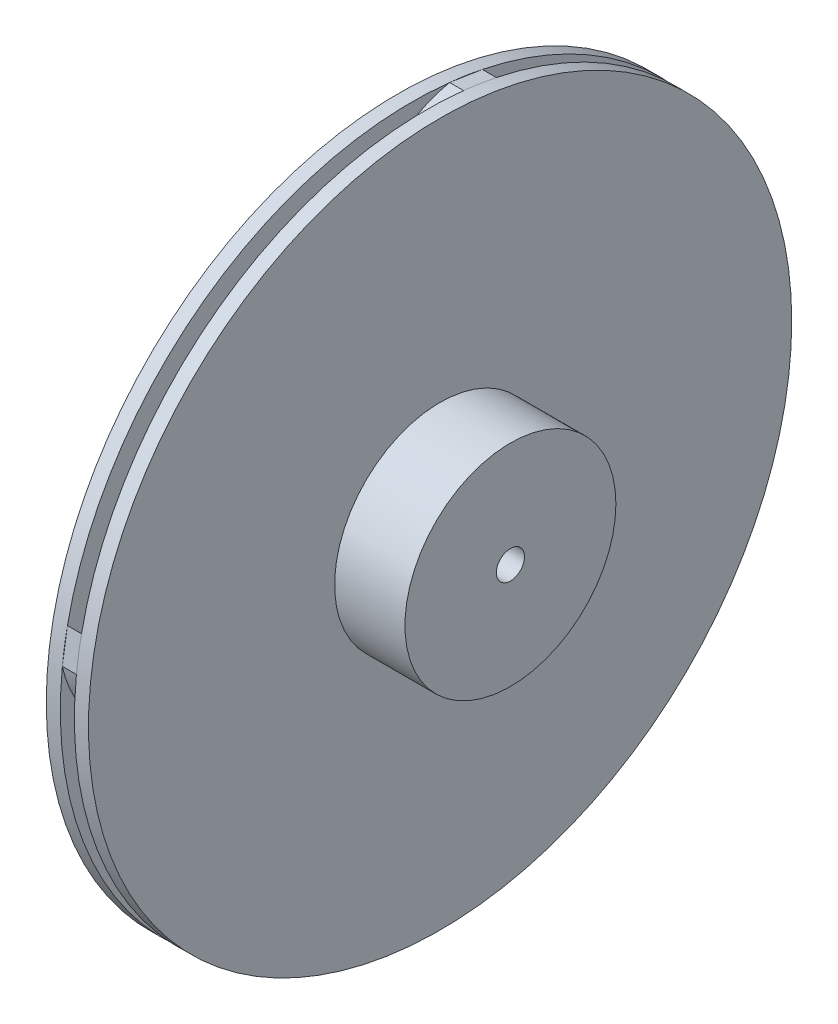
ISO-10303-21;
HEADER;
FILE_DESCRIPTION(('STEP AP214'),'2;1');
FILE_NAME('part.step','',(''),(''),'','','');
FILE_SCHEMA(('AUTOMOTIVE_DESIGN { 1 0 10303 214 1 1 1 1 }'));
ENDSEC;
DATA;
#1=APPLICATION_CONTEXT('core data for automotive mechanical design processes');
#2=APPLICATION_PROTOCOL_DEFINITION('international standard','automotive_design',2000,#1);
#3=PRODUCT_CONTEXT('',#1,'mechanical');
#4=PRODUCT('Part','Part','',(#3));
#5=PRODUCT_RELATED_PRODUCT_CATEGORY('part','',(#4));
#6=PRODUCT_DEFINITION_FORMATION('','',#4);
#7=PRODUCT_DEFINITION_CONTEXT('part definition',#1,'design');
#8=PRODUCT_DEFINITION('design','',#6,#7);
#9=PRODUCT_DEFINITION_SHAPE('','',#8);
#10=(LENGTH_UNIT() NAMED_UNIT(*) SI_UNIT(.MILLI.,.METRE.));
#11=(NAMED_UNIT(*) PLANE_ANGLE_UNIT() SI_UNIT($,.RADIAN.));
#12=(NAMED_UNIT(*) SI_UNIT($,.STERADIAN.) SOLID_ANGLE_UNIT());
#13=UNCERTAINTY_MEASURE_WITH_UNIT(LENGTH_MEASURE(1.E-05),#10,'distance_accuracy_value','');
#14=(GEOMETRIC_REPRESENTATION_CONTEXT(3) GLOBAL_UNCERTAINTY_ASSIGNED_CONTEXT((#13)) GLOBAL_UNIT_ASSIGNED_CONTEXT((#10,
#11,#12)) REPRESENTATION_CONTEXT('',''));
#15=CARTESIAN_POINT('',(0.,0.,0.));
#16=DIRECTION('',(0.,0.,1.));
#17=DIRECTION('',(1.,0.,0.));
#18=AXIS2_PLACEMENT_3D('',#15,#16,#17);
#19=CARTESIAN_POINT('',(0.,7.12628691593959,-14.723543306288));
#20=DIRECTION('',(1.,0.,0.));
#21=DIRECTION('',(0.,0.,-1.));
#22=AXIS2_PLACEMENT_3D('',#19,#20,#21);
#23=PLANE('',#22);
#24=CARTESIAN_POINT('',(0.,0.,0.));
#25=DIRECTION('',(1.,0.,0.));
#26=DIRECTION('',(0.,0.,-1.));
#27=AXIS2_PLACEMENT_3D('',#24,#25,#26);
#28=CIRCLE('',#27,5.);
#29=CARTESIAN_POINT('',(0.,5.,0.));
#30=VERTEX_POINT('',#29);
#31=CARTESIAN_POINT('',(0.,4.77189603041447,1.49298636126208));
#32=VERTEX_POINT('',#31);
#33=EDGE_CURVE('E190',#30,#32,#28,.T.);
#34=ORIENTED_EDGE('',*,*,#33,.F.);
#35=CARTESIAN_POINT('',(0.,4.77189603041447,1.49298636126208));
#36=CARTESIAN_POINT('',(0.,5.,0.));
#37=B_SPLINE_CURVE_WITH_KNOTS('',1,(#35,#36),.UNSPECIFIED.,.F.,.F.,(2,2),(0.,1.),.UNSPECIFIED.);
#38=EDGE_CURVE('E253',#32,#30,#37,.T.);
#39=ORIENTED_EDGE('',*,*,#38,.F.);
#40=EDGE_LOOP('',(#34,#39));
#41=FACE_BOUND('',#40,.T.);
#42=ADVANCED_FACE('F33',(#41),#23,.F.);
#43=CARTESIAN_POINT('',(0.,-14.7235433062881,-7.12628691593953));
#44=DIRECTION('',(1.,0.,0.));
#45=DIRECTION('',(0.,0.,-1.));
#46=AXIS2_PLACEMENT_3D('',#43,#44,#45);
#47=PLANE('',#46);
#48=CARTESIAN_POINT('',(0.,0.,-5.));
#49=VERTEX_POINT('',#48);
#50=CARTESIAN_POINT('',(0.,1.49298636126206,-4.77189603041448));
#51=VERTEX_POINT('',#50);
#52=EDGE_CURVE('E43',#49,#51,#28,.T.);
#53=ORIENTED_EDGE('',*,*,#52,.F.);
#54=CARTESIAN_POINT('',(0.,1.49298636126206,-4.77189603041448));
#55=CARTESIAN_POINT('',(0.,0.,-5.));
#56=B_SPLINE_CURVE_WITH_KNOTS('',1,(#54,#55),.UNSPECIFIED.,.F.,.F.,(2,2),(0.,1.),.UNSPECIFIED.);
#57=EDGE_CURVE('E150',#51,#49,#56,.T.);
#58=ORIENTED_EDGE('',*,*,#57,.F.);
#59=EDGE_LOOP('',(#53,#58));
#60=FACE_BOUND('',#59,.T.);
#61=ADVANCED_FACE('F152',(#60),#47,.F.);
#62=CARTESIAN_POINT('',(0.,-7.12628691593948,14.7235433062881));
#63=DIRECTION('',(1.,0.,0.));
#64=DIRECTION('',(0.,0.,-1.));
#65=AXIS2_PLACEMENT_3D('',#62,#63,#64);
#66=PLANE('',#65);
#67=CARTESIAN_POINT('',(0.,-5.,0.));
#68=VERTEX_POINT('',#67);
#69=CARTESIAN_POINT('',(0.,-4.77189603041448,-1.49298636126205));
#70=VERTEX_POINT('',#69);
#71=EDGE_CURVE('E201',#68,#70,#28,.T.);
#72=ORIENTED_EDGE('',*,*,#71,.F.);
#73=CARTESIAN_POINT('',(0.,-4.77189603041448,-1.49298636126205));
#74=CARTESIAN_POINT('',(0.,-5.,0.));
#75=B_SPLINE_CURVE_WITH_KNOTS('',1,(#73,#74),.UNSPECIFIED.,.F.,.F.,(2,2),(0.,1.),.UNSPECIFIED.);
#76=EDGE_CURVE('E372',#70,#68,#75,.T.);
#77=ORIENTED_EDGE('',*,*,#76,.F.);
#78=EDGE_LOOP('',(#72,#77));
#79=FACE_BOUND('',#78,.T.);
#80=ADVANCED_FACE('F464',(#79),#66,.F.);
#81=CARTESIAN_POINT('',(0.,14.7235433062881,7.12628691593943));
#82=DIRECTION('',(1.,0.,0.));
#83=DIRECTION('',(0.,0.,-1.));
#84=AXIS2_PLACEMENT_3D('',#81,#82,#83);
#85=PLANE('',#84);
#86=CARTESIAN_POINT('',(0.,0.,5.));
#87=VERTEX_POINT('',#86);
#88=CARTESIAN_POINT('',(0.,-1.49298636126203,4.77189603041449));
#89=VERTEX_POINT('',#88);
#90=EDGE_CURVE('E11',#87,#89,#28,.T.);
#91=ORIENTED_EDGE('',*,*,#90,.F.);
#92=CARTESIAN_POINT('',(0.,-1.49298636126203,4.77189603041449));
#93=CARTESIAN_POINT('',(0.,0.,5.));
#94=B_SPLINE_CURVE_WITH_KNOTS('',1,(#92,#93),.UNSPECIFIED.,.F.,.F.,(2,2),(0.,1.),.UNSPECIFIED.);
#95=EDGE_CURVE('E584',#89,#87,#94,.T.);
#96=ORIENTED_EDGE('',*,*,#95,.F.);
#97=EDGE_LOOP('',(#91,#96));
#98=FACE_BOUND('',#97,.T.);
#99=ADVANCED_FACE('F448',(#98),#85,.F.);
#100=CARTESIAN_POINT('',(1.,0.,0.));
#101=DIRECTION('',(1.,0.,0.));
#102=DIRECTION('',(0.,0.,-1.));
#103=AXIS2_PLACEMENT_3D('',#100,#101,#102);
#104=PLANE('',#103);
#105=CARTESIAN_POINT('',(1.,0.,5.));
#106=CARTESIAN_POINT('',(1.,4.49752966090155,10.7345356444935));
#107=CARTESIAN_POINT('',(1.,18.0772656213493,8.40439040059219));
#108=CARTESIAN_POINT('',(1.,22.9031519708675,-1.37145407623374));
#109=CARTESIAN_POINT('',(1.,24.4948974278317,-5.00000000000025));
#110=B_SPLINE_CURVE_WITH_KNOTS('',3,(#105,#106,#107,#108,#109),.UNSPECIFIED.,.F.,.F.,(4,1,4),
(0.,0.618777627560053,1.),.UNSPECIFIED.);
#111=CARTESIAN_POINT('',(1.,0.,5.));
#112=VERTEX_POINT('',#111);
#113=CARTESIAN_POINT('',(1.,24.4948974278318,-5.0000000000001));
#114=VERTEX_POINT('',#113);
#115=EDGE_CURVE('E58',#112,#114,#110,.T.);
#116=ORIENTED_EDGE('',*,*,#115,.T.);
#117=CARTESIAN_POINT('',(1.,0.,0.));
#118=DIRECTION('',(1.,0.,0.));
#119=DIRECTION('',(0.,0.,-1.));
#120=AXIS2_PLACEMENT_3D('',#117,#118,#119);
#121=CIRCLE('',#120,25.);
#122=CARTESIAN_POINT('',(1.,-2.6730314072638,-24.8566872912659));
#123=VERTEX_POINT('',#122);
#124=EDGE_CURVE('E259',#123,#114,#121,.T.);
#125=ORIENTED_EDGE('',*,*,#124,.F.);
#126=CARTESIAN_POINT('',(1.,-2.6730314072638,-24.8566872912659));
#127=CARTESIAN_POINT('',(1.,-1.10498355753693,-24.5506183011015));
#128=CARTESIAN_POINT('',(1.,2.35094401884182,-22.3919045737709));
#129=CARTESIAN_POINT('',(1.,7.16558422053054,-18.6304853513954));
#130=CARTESIAN_POINT('',(1.,10.3228529409846,-12.6682103367622));
#131=CARTESIAN_POINT('',(1.,11.0632116871101,-6.922460382645));
#132=CARTESIAN_POINT('',(1.,9.37578297149706,-1.51635149298295));
#133=CARTESIAN_POINT('',(1.,6.92341697117121,1.33443590127004));
#134=CARTESIAN_POINT('',(1.,4.77189603041447,1.49298636126208));
#135=B_SPLINE_CURVE_WITH_KNOTS('',3,(#126,#127,#128,#129,#130,#131,#132,#133,#134),
.UNSPECIFIED.,.F.,.F.,(4,1,1,1,1,1,4),(0.,0.135621201148051,0.347195592503912,0.517383452822031,
0.703735102708078,0.827493936990259,1.),.UNSPECIFIED.);
#136=CARTESIAN_POINT('',(1.,4.77189603041447,1.49298636126208));
#137=VERTEX_POINT('',#136);
#138=EDGE_CURVE('E301',#123,#137,#135,.T.);
#139=ORIENTED_EDGE('',*,*,#138,.T.);
#140=CARTESIAN_POINT('',(1.,0.,0.));
#141=DIRECTION('',(1.,0.,0.));
#142=DIRECTION('',(0.,0.,-1.));
#143=AXIS2_PLACEMENT_3D('',#140,#141,#142);
#144=CIRCLE('',#143,5.);
#145=EDGE_CURVE('E516',#137,#112,#144,.T.);
#146=ORIENTED_EDGE('',*,*,#145,.T.);
#147=EDGE_LOOP('',(#116,#125,#139,#146));
#148=FACE_BOUND('',#147,.T.);
#149=ADVANCED_FACE('F444',(#148),#104,.F.);
#150=CARTESIAN_POINT('',(1.,24.4948974278317,-5.00000000000026));
#151=CARTESIAN_POINT('',(1.,24.8566872912659,-2.67303140726406));
#152=B_SPLINE_CURVE_WITH_KNOTS('',1,(#150,#151),.UNSPECIFIED.,.F.,.F.,(2,2),(0.,1.),.UNSPECIFIED.);
#153=CARTESIAN_POINT('',(1.,24.8566872912659,-2.67303140726406));
#154=VERTEX_POINT('',#153);
#155=EDGE_CURVE('E50',#114,#154,#152,.T.);
#156=ORIENTED_EDGE('',*,*,#155,.T.);
#157=EDGE_CURVE('E542',#114,#154,#121,.T.);
#158=ORIENTED_EDGE('',*,*,#157,.F.);
#159=EDGE_LOOP('',(#156,#158));
#160=FACE_BOUND('',#159,.T.);
#161=ADVANCED_FACE('F447',(#160),#104,.F.);
#162=CARTESIAN_POINT('',(1.,24.8566872912659,-2.67303140726406));
#163=CARTESIAN_POINT('',(1.,24.5506183011015,-1.10498355753719));
#164=CARTESIAN_POINT('',(1.,22.3919045737709,2.35094401884158));
#165=CARTESIAN_POINT('',(1.,18.6304853513955,7.16558422053034));
#166=CARTESIAN_POINT('',(1.,12.6682103367623,10.3228529409845));
#167=CARTESIAN_POINT('',(1.,6.92246038264511,11.06321168711));
#168=CARTESIAN_POINT('',(1.,1.51635149298305,9.37578297149705));
#169=CARTESIAN_POINT('',(1.,-1.33443590126997,6.92341697117123));
#170=CARTESIAN_POINT('',(1.,-1.49298636126203,4.77189603041449));
#171=B_SPLINE_CURVE_WITH_KNOTS('',3,(#162,#163,#164,#165,#166,#167,#168,#169,#170),
.UNSPECIFIED.,.F.,.F.,(4,1,1,1,1,1,4),(0.,0.135621201148051,0.347195592503912,0.517383452822031,
0.703735102708078,0.827493936990259,1.),.UNSPECIFIED.);
#172=CARTESIAN_POINT('',(1.,-1.49298636126203,4.77189603041449));
#173=VERTEX_POINT('',#172);
#174=EDGE_CURVE('E564',#154,#173,#171,.T.);
#175=ORIENTED_EDGE('',*,*,#174,.T.);
#176=CARTESIAN_POINT('',(1.,-5.,0.));
#177=VERTEX_POINT('',#176);
#178=EDGE_CURVE('E518',#173,#177,#144,.T.);
#179=ORIENTED_EDGE('',*,*,#178,.T.);
#180=CARTESIAN_POINT('',(1.,-5.,0.));
#181=CARTESIAN_POINT('',(1.,-10.7345356444935,4.49752966090151));
#182=CARTESIAN_POINT('',(1.,-8.40439040059226,18.0772656213493));
#183=CARTESIAN_POINT('',(1.,1.37145407623366,22.9031519708675));
#184=CARTESIAN_POINT('',(1.,5.00000000000017,24.4948974278318));
#185=B_SPLINE_CURVE_WITH_KNOTS('',3,(#180,#181,#182,#183,#184),.UNSPECIFIED.,.F.,.F.,(4,1,4),
(0.,0.618777627560053,1.),.UNSPECIFIED.);
#186=CARTESIAN_POINT('',(1.,5.00000000000008,24.4948974278318));
#187=VERTEX_POINT('',#186);
#188=EDGE_CURVE('E628',#177,#187,#185,.T.);
#189=ORIENTED_EDGE('',*,*,#188,.T.);
#190=EDGE_CURVE('E261',#154,#187,#121,.T.);
#191=ORIENTED_EDGE('',*,*,#190,.F.);
#192=EDGE_LOOP('',(#175,#179,#189,#191));
#193=FACE_BOUND('',#192,.T.);
#194=ADVANCED_FACE('F654',(#193),#104,.F.);
#195=CARTESIAN_POINT('',(1.,5.00000000000017,24.4948974278318));
#196=CARTESIAN_POINT('',(1.,2.67303140726398,24.8566872912659));
#197=B_SPLINE_CURVE_WITH_KNOTS('',1,(#195,#196),.UNSPECIFIED.,.F.,.F.,(2,2),(0.,1.),.UNSPECIFIED.);
#198=CARTESIAN_POINT('',(1.,2.67303140726398,24.8566872912659));
#199=VERTEX_POINT('',#198);
#200=EDGE_CURVE('E621',#187,#199,#197,.T.);
#201=ORIENTED_EDGE('',*,*,#200,.T.);
#202=EDGE_CURVE('E534',#187,#199,#121,.T.);
#203=ORIENTED_EDGE('',*,*,#202,.F.);
#204=EDGE_LOOP('',(#201,#203));
#205=FACE_BOUND('',#204,.T.);
#206=ADVANCED_FACE('F656',(#205),#104,.F.);
#207=CARTESIAN_POINT('',(1.,2.67303140726398,24.8566872912659));
#208=CARTESIAN_POINT('',(1.,1.1049835575371,24.5506183011015));
#209=CARTESIAN_POINT('',(1.,-2.35094401884166,22.3919045737709));
#210=CARTESIAN_POINT('',(1.,-7.1655842205304,18.6304853513955));
#211=CARTESIAN_POINT('',(1.,-10.3228529409845,12.6682103367623));
#212=CARTESIAN_POINT('',(1.,-11.06321168711,6.92246038264507));
#213=CARTESIAN_POINT('',(1.,-9.37578297149705,1.51635149298301));
#214=CARTESIAN_POINT('',(1.,-6.92341697117122,-1.33443590126999));
#215=CARTESIAN_POINT('',(1.,-4.77189603041448,-1.49298636126205));
#216=B_SPLINE_CURVE_WITH_KNOTS('',3,(#207,#208,#209,#210,#211,#212,#213,#214,#215),
.UNSPECIFIED.,.F.,.F.,(4,1,1,1,1,1,4),(0.,0.135621201148051,0.347195592503912,0.517383452822031,
0.703735102708078,0.827493936990259,1.),.UNSPECIFIED.);
#217=CARTESIAN_POINT('',(1.,-4.77189603041448,-1.49298636126205));
#218=VERTEX_POINT('',#217);
#219=EDGE_CURVE('E405',#199,#218,#216,.T.);
#220=ORIENTED_EDGE('',*,*,#219,.T.);
#221=CARTESIAN_POINT('',(1.,0.,-5.));
#222=VERTEX_POINT('',#221);
#223=EDGE_CURVE('E515',#218,#222,#144,.T.);
#224=ORIENTED_EDGE('',*,*,#223,.T.);
#225=CARTESIAN_POINT('',(1.,0.,-5.));
#226=CARTESIAN_POINT('',(1.,-4.49752966090147,-10.7345356444935));
#227=CARTESIAN_POINT('',(1.,-18.0772656213492,-8.40439040059232));
#228=CARTESIAN_POINT('',(1.,-22.9031519708675,1.37145407623358));
#229=CARTESIAN_POINT('',(1.,-24.4948974278318,5.00000000000008));
#230=B_SPLINE_CURVE_WITH_KNOTS('',3,(#225,#226,#227,#228,#229),.UNSPECIFIED.,.F.,.F.,(4,1,4),
(0.,0.618777627560053,1.),.UNSPECIFIED.);
#231=CARTESIAN_POINT('',(1.,-24.4948974278318,5.00000000000006));
#232=VERTEX_POINT('',#231);
#233=EDGE_CURVE('E414',#222,#232,#230,.T.);
#234=ORIENTED_EDGE('',*,*,#233,.T.);
#235=EDGE_CURVE('E538',#199,#232,#121,.T.);
#236=ORIENTED_EDGE('',*,*,#235,.F.);
#237=EDGE_LOOP('',(#220,#224,#234,#236));
#238=FACE_BOUND('',#237,.T.);
#239=ADVANCED_FACE('F658',(#238),#104,.F.);
#240=CARTESIAN_POINT('',(1.,-24.4948974278318,5.00000000000009));
#241=CARTESIAN_POINT('',(1.,-24.8566872912659,2.67303140726389));
#242=B_SPLINE_CURVE_WITH_KNOTS('',1,(#240,#241),.UNSPECIFIED.,.F.,.F.,(2,2),(0.,1.),.UNSPECIFIED.);
#243=CARTESIAN_POINT('',(1.,-24.8566872912659,2.67303140726389));
#244=VERTEX_POINT('',#243);
#245=EDGE_CURVE('E423',#232,#244,#242,.T.);
#246=ORIENTED_EDGE('',*,*,#245,.T.);
#247=EDGE_CURVE('E533',#232,#244,#121,.T.);
#248=ORIENTED_EDGE('',*,*,#247,.F.);
#249=EDGE_LOOP('',(#246,#248));
#250=FACE_BOUND('',#249,.T.);
#251=ADVANCED_FACE('F458',(#250),#104,.F.);
#252=CARTESIAN_POINT('',(1.,-24.8566872912659,2.67303140726389));
#253=CARTESIAN_POINT('',(1.,-24.5506183011015,1.10498355753702));
#254=CARTESIAN_POINT('',(1.,-22.3919045737709,-2.35094401884174));
#255=CARTESIAN_POINT('',(1.,-18.6304853513954,-7.16558422053047));
#256=CARTESIAN_POINT('',(1.,-12.6682103367622,-10.3228529409846));
#257=CARTESIAN_POINT('',(1.,-6.92246038264504,-11.0632116871101));
#258=CARTESIAN_POINT('',(1.,-1.51635149298298,-9.37578297149706));
#259=CARTESIAN_POINT('',(1.,1.33443590127001,-6.92341697117122));
#260=CARTESIAN_POINT('',(1.,1.49298636126206,-4.77189603041448));
#261=B_SPLINE_CURVE_WITH_KNOTS('',3,(#252,#253,#254,#255,#256,#257,#258,#259,#260),
.UNSPECIFIED.,.F.,.F.,(4,1,1,1,1,1,4),(0.,0.135621201148051,0.347195592503912,0.517383452822031,
0.703735102708078,0.827493936990259,1.),.UNSPECIFIED.);
#262=CARTESIAN_POINT('',(1.,1.49298636126206,-4.77189603041448));
#263=VERTEX_POINT('',#262);
#264=EDGE_CURVE('E171',#244,#263,#261,.T.);
#265=ORIENTED_EDGE('',*,*,#264,.T.);
#266=CARTESIAN_POINT('',(1.,5.,0.));
#267=VERTEX_POINT('',#266);
#268=EDGE_CURVE('E509',#263,#267,#144,.T.);
#269=ORIENTED_EDGE('',*,*,#268,.T.);
#270=CARTESIAN_POINT('',(1.,5.,0.));
#271=CARTESIAN_POINT('',(1.,10.7345356444935,-4.49752966090144));
#272=CARTESIAN_POINT('',(1.,8.40439040059238,-18.0772656213492));
#273=CARTESIAN_POINT('',(1.,-1.37145407623349,-22.9031519708675));
#274=CARTESIAN_POINT('',(1.,-5.,-24.4948974278318));
#275=B_SPLINE_CURVE_WITH_KNOTS('',3,(#270,#271,#272,#273,#274),.UNSPECIFIED.,.F.,.F.,(4,1,4),
(0.,0.618777627560054,1.),.UNSPECIFIED.);
#276=CARTESIAN_POINT('',(1.,-4.99999999999993,-24.4948974278318));
#277=VERTEX_POINT('',#276);
#278=EDGE_CURVE('E271',#267,#277,#275,.T.);
#279=ORIENTED_EDGE('',*,*,#278,.T.);
#280=EDGE_CURVE('E532',#244,#277,#121,.T.);
#281=ORIENTED_EDGE('',*,*,#280,.F.);
#282=EDGE_LOOP('',(#265,#269,#279,#281));
#283=FACE_BOUND('',#282,.T.);
#284=ADVANCED_FACE('F452',(#283),#104,.F.);
#285=CARTESIAN_POINT('',(1.,7.12628691593959,-14.723543306288));
#286=DIRECTION('',(1.,0.,0.));
#287=DIRECTION('',(0.,0.,-1.));
#288=AXIS2_PLACEMENT_3D('',#285,#286,#287);
#289=PLANE('',#288);
#290=CARTESIAN_POINT('',(1.,4.77189603041447,1.49298636126208));
#291=CARTESIAN_POINT('',(1.,5.,0.));
#292=B_SPLINE_CURVE_WITH_KNOTS('',1,(#290,#291),.UNSPECIFIED.,.F.,.F.,(2,2),(0.,1.),.UNSPECIFIED.);
#293=EDGE_CURVE('E266',#137,#267,#292,.T.);
#294=ORIENTED_EDGE('',*,*,#293,.T.);
#295=EDGE_CURVE('E263',#267,#137,#144,.T.);
#296=ORIENTED_EDGE('',*,*,#295,.T.);
#297=EDGE_LOOP('',(#294,#296));
#298=FACE_BOUND('',#297,.T.);
#299=ADVANCED_FACE('F450',(#298),#289,.T.);
#300=CARTESIAN_POINT('',(1.,4.77189603041447,1.49298636126208));
#301=DIRECTION('',(0.,0.988529009711626,0.151031112551529));
#302=DIRECTION('',(0.,-0.151031112551529,0.988529009711626));
#303=AXIS2_PLACEMENT_3D('',#300,#301,#302);
#304=PLANE('',#303);
#305=ORIENTED_EDGE('',*,*,#38,.T.);
#306=DIRECTION('',(-1.,0.,0.));
#307=VECTOR('',#306,1.);
#308=CARTESIAN_POINT('',(1.,5.,0.));
#309=LINE('',#308,#307);
#310=EDGE_CURVE('E37',#267,#30,#309,.T.);
#311=ORIENTED_EDGE('',*,*,#310,.F.);
#312=ORIENTED_EDGE('',*,*,#293,.F.);
#313=DIRECTION('',(-1.,0.,0.));
#314=VECTOR('',#313,1.);
#315=CARTESIAN_POINT('',(1.,4.77189603041447,1.49298636126208));
#316=LINE('',#315,#314);
#317=EDGE_CURVE('E306',#137,#32,#316,.T.);
#318=ORIENTED_EDGE('',*,*,#317,.T.);
#319=EDGE_LOOP('',(#305,#311,#312,#318));
#320=FACE_BOUND('',#319,.T.);
#321=ADVANCED_FACE('F35',(#320),#304,.F.);
#322=DIRECTION('',(-1.,0.,0.));
#323=VECTOR('',#322,1.);
#324=SURFACE_OF_LINEAR_EXTRUSION('',#275,#323);
#325=CARTESIAN_POINT('',(0.,5.,0.));
#326=CARTESIAN_POINT('',(0.,10.7345356444935,-4.49752966090144));
#327=CARTESIAN_POINT('',(0.,8.40439040059238,-18.0772656213492));
#328=CARTESIAN_POINT('',(0.,-1.37145407623349,-22.9031519708675));
#329=CARTESIAN_POINT('',(0.,-5.,-24.4948974278318));
#330=B_SPLINE_CURVE_WITH_KNOTS('',3,(#325,#326,#327,#328,#329),.UNSPECIFIED.,.F.,.F.,(4,1,4),
(0.,0.618777627560054,1.),.UNSPECIFIED.);
#331=CARTESIAN_POINT('',(0.,-5.,-24.4948974278318));
#332=VERTEX_POINT('',#331);
#333=EDGE_CURVE('E187',#30,#332,#330,.T.);
#334=ORIENTED_EDGE('',*,*,#333,.T.);
#335=DIRECTION('',(-1.,0.,0.));
#336=VECTOR('',#335,1.);
#337=CARTESIAN_POINT('',(1.,-5.,-24.4948974278318));
#338=LINE('',#337,#336);
#339=EDGE_CURVE('E340',#277,#332,#338,.T.);
#340=ORIENTED_EDGE('',*,*,#339,.F.);
#341=ORIENTED_EDGE('',*,*,#278,.F.);
#342=ORIENTED_EDGE('',*,*,#310,.T.);
#343=EDGE_LOOP('',(#334,#340,#341,#342));
#344=FACE_BOUND('',#343,.T.);
#345=ADVANCED_FACE('F288',(#344),#324,.F.);
#346=CARTESIAN_POINT('',(1.,-5.,-24.4948974278318));
#347=DIRECTION('',(0.,0.153631120391854,0.988128270442226));
#348=DIRECTION('',(0.,-0.988128270442226,0.153631120391854));
#349=AXIS2_PLACEMENT_3D('',#346,#347,#348);
#350=PLANE('',#349);
#351=CARTESIAN_POINT('',(0.,-5.,-24.4948974278318));
#352=CARTESIAN_POINT('',(0.,-2.6730314072638,-24.8566872912659));
#353=B_SPLINE_CURVE_WITH_KNOTS('',1,(#351,#352),.UNSPECIFIED.,.F.,.F.,(2,2),(0.,1.),.UNSPECIFIED.);
#354=CARTESIAN_POINT('',(0.,-2.6730314072638,-24.8566872912659));
#355=VERTEX_POINT('',#354);
#356=EDGE_CURVE('E319',#332,#355,#353,.T.);
#357=ORIENTED_EDGE('',*,*,#356,.T.);
#358=DIRECTION('',(-1.,0.,0.));
#359=VECTOR('',#358,1.);
#360=CARTESIAN_POINT('',(1.,-2.6730314072638,-24.8566872912659));
#361=LINE('',#360,#359);
#362=EDGE_CURVE('E338',#123,#355,#361,.T.);
#363=ORIENTED_EDGE('',*,*,#362,.F.);
#364=CARTESIAN_POINT('',(1.,-5.,-24.4948974278318));
#365=CARTESIAN_POINT('',(1.,-2.6730314072638,-24.8566872912659));
#366=B_SPLINE_CURVE_WITH_KNOTS('',1,(#364,#365),.UNSPECIFIED.,.F.,.F.,(2,2),(0.,1.),.UNSPECIFIED.);
#367=EDGE_CURVE('E281',#277,#123,#366,.T.);
#368=ORIENTED_EDGE('',*,*,#367,.F.);
#369=ORIENTED_EDGE('',*,*,#339,.T.);
#370=EDGE_LOOP('',(#357,#363,#368,#369));
#371=FACE_BOUND('',#370,.T.);
#372=ADVANCED_FACE('F291',(#371),#350,.F.);
#373=DIRECTION('',(-1.,0.,0.));
#374=VECTOR('',#373,1.);
#375=SURFACE_OF_LINEAR_EXTRUSION('',#135,#374);
#376=CARTESIAN_POINT('',(0.,-2.6730314072638,-24.8566872912659));
#377=CARTESIAN_POINT('',(0.,-1.10498355753693,-24.5506183011015));
#378=CARTESIAN_POINT('',(0.,2.35094401884182,-22.3919045737709));
#379=CARTESIAN_POINT('',(0.,7.16558422053054,-18.6304853513954));
#380=CARTESIAN_POINT('',(0.,10.3228529409846,-12.6682103367622));
#381=CARTESIAN_POINT('',(0.,11.0632116871101,-6.922460382645));
#382=CARTESIAN_POINT('',(0.,9.37578297149706,-1.51635149298295));
#383=CARTESIAN_POINT('',(0.,6.92341697117121,1.33443590127004));
#384=CARTESIAN_POINT('',(0.,4.77189603041447,1.49298636126208));
#385=B_SPLINE_CURVE_WITH_KNOTS('',3,(#376,#377,#378,#379,#380,#381,#382,#383,#384),
.UNSPECIFIED.,.F.,.F.,(4,1,1,1,1,1,4),(0.,0.135621201148051,0.347195592503912,0.517383452822031,
0.703735102708078,0.827493936990259,1.),.UNSPECIFIED.);
#386=EDGE_CURVE('E272',#355,#32,#385,.T.);
#387=ORIENTED_EDGE('',*,*,#386,.T.);
#388=ORIENTED_EDGE('',*,*,#317,.F.);
#389=ORIENTED_EDGE('',*,*,#138,.F.);
#390=ORIENTED_EDGE('',*,*,#362,.T.);
#391=EDGE_LOOP('',(#387,#388,#389,#390));
#392=FACE_BOUND('',#391,.T.);
#393=ADVANCED_FACE('F295',(#392),#375,.F.);
#394=EDGE_CURVE('E254',#277,#123,#121,.T.);
#395=ORIENTED_EDGE('',*,*,#394,.F.);
#396=ORIENTED_EDGE('',*,*,#367,.T.);
#397=EDGE_LOOP('',(#395,#396));
#398=FACE_BOUND('',#397,.T.);
#399=ADVANCED_FACE('F247',(#398),#104,.F.);
#400=CARTESIAN_POINT('',(2.,0.,0.));
#401=DIRECTION('',(1.,0.,0.));
#402=DIRECTION('',(0.,0.,-1.));
#403=AXIS2_PLACEMENT_3D('',#400,#401,#402);
#404=PLANE('',#403);
#405=CARTESIAN_POINT('',(2.,0.,0.));
#406=DIRECTION('',(1.,0.,0.));
#407=DIRECTION('',(0.,0.,-1.));
#408=AXIS2_PLACEMENT_3D('',#405,#406,#407);
#409=CIRCLE('',#408,7.5);
#410=CARTESIAN_POINT('',(2.,0.,-7.5));
#411=VERTEX_POINT('',#410);
#412=EDGE_CURVE('E210',#411,#411,#409,.T.);
#413=ORIENTED_EDGE('',*,*,#412,.F.);
#414=EDGE_LOOP('',(#413));
#415=FACE_BOUND('',#414,.T.);
#416=CARTESIAN_POINT('',(2.,0.,0.));
#417=DIRECTION('',(1.,0.,0.));
#418=DIRECTION('',(0.,0.,-1.));
#419=AXIS2_PLACEMENT_3D('',#416,#417,#418);
#420=CIRCLE('',#419,25.);
#421=CARTESIAN_POINT('',(2.,0.,-25.));
#422=VERTEX_POINT('',#421);
#423=EDGE_CURVE('E251',#422,#422,#420,.T.);
#424=ORIENTED_EDGE('',*,*,#423,.T.);
#425=EDGE_LOOP('',(#424));
#426=FACE_BOUND('',#425,.T.);
#427=ADVANCED_FACE('F243',(#415,#426),#404,.T.);
#428=CARTESIAN_POINT('',(2.,0.,0.));
#429=DIRECTION('',(-1.,0.,0.));
#430=DIRECTION('',(0.,0.,1.));
#431=AXIS2_PLACEMENT_3D('',#428,#429,#430);
#432=CYLINDRICAL_SURFACE('',#431,25.);
#433=ORIENTED_EDGE('',*,*,#423,.F.);
#434=EDGE_LOOP('',(#433));
#435=FACE_BOUND('',#434,.T.);
#436=ORIENTED_EDGE('',*,*,#394,.T.);
#437=ORIENTED_EDGE('',*,*,#124,.T.);
#438=ORIENTED_EDGE('',*,*,#157,.T.);
#439=ORIENTED_EDGE('',*,*,#190,.T.);
#440=ORIENTED_EDGE('',*,*,#202,.T.);
#441=ORIENTED_EDGE('',*,*,#235,.T.);
#442=ORIENTED_EDGE('',*,*,#247,.T.);
#443=ORIENTED_EDGE('',*,*,#280,.T.);
#444=EDGE_LOOP('',(#436,#437,#438,#439,#440,#441,#442,#443));
#445=FACE_BOUND('',#444,.T.);
#446=ADVANCED_FACE('F246',(#435,#445),#432,.T.);
#447=CARTESIAN_POINT('',(2.,0.,0.));
#448=DIRECTION('',(-1.,0.,0.));
#449=DIRECTION('',(0.,0.,1.));
#450=AXIS2_PLACEMENT_3D('',#447,#448,#449);
#451=CYLINDRICAL_SURFACE('',#450,5.);
#452=CARTESIAN_POINT('',(2.,0.,0.));
#453=DIRECTION('',(1.,0.,0.));
#454=DIRECTION('',(0.,0.,-1.));
#455=AXIS2_PLACEMENT_3D('',#452,#453,#454);
#456=CIRCLE('',#455,5.);
#457=CARTESIAN_POINT('',(2.,0.,-5.));
#458=VERTEX_POINT('',#457);
#459=EDGE_CURVE('E202',#458,#458,#456,.T.);
#460=ORIENTED_EDGE('',*,*,#459,.T.);
#461=EDGE_LOOP('',(#460));
#462=FACE_BOUND('',#461,.T.);
#463=ORIENTED_EDGE('',*,*,#295,.F.);
#464=ORIENTED_EDGE('',*,*,#268,.F.);
#465=EDGE_CURVE('E511',#222,#263,#144,.T.);
#466=ORIENTED_EDGE('',*,*,#465,.F.);
#467=ORIENTED_EDGE('',*,*,#223,.F.);
#468=EDGE_CURVE('E512',#177,#218,#144,.T.);
#469=ORIENTED_EDGE('',*,*,#468,.F.);
#470=ORIENTED_EDGE('',*,*,#178,.F.);
#471=EDGE_CURVE('E523',#112,#173,#144,.T.);
#472=ORIENTED_EDGE('',*,*,#471,.F.);
#473=ORIENTED_EDGE('',*,*,#145,.F.);
#474=EDGE_LOOP('',(#463,#464,#466,#467,#469,#470,#472,#473));
#475=FACE_BOUND('',#474,.T.);
#476=ADVANCED_FACE('F441',(#462,#475),#451,.F.);
#477=CARTESIAN_POINT('',(1.,-14.7235433062881,-7.12628691593953));
#478=DIRECTION('',(1.,0.,0.));
#479=DIRECTION('',(0.,0.,-1.));
#480=AXIS2_PLACEMENT_3D('',#477,#478,#479);
#481=PLANE('',#480);
#482=CARTESIAN_POINT('',(1.,1.49298636126206,-4.77189603041448));
#483=CARTESIAN_POINT('',(1.,0.,-5.));
#484=B_SPLINE_CURVE_WITH_KNOTS('',1,(#482,#483),.UNSPECIFIED.,.F.,.F.,(2,2),(0.,1.),.UNSPECIFIED.);
#485=EDGE_CURVE('E167',#263,#222,#484,.T.);
#486=ORIENTED_EDGE('',*,*,#485,.T.);
#487=ORIENTED_EDGE('',*,*,#465,.T.);
#488=EDGE_LOOP('',(#486,#487));
#489=FACE_BOUND('',#488,.T.);
#490=ADVANCED_FACE('F440',(#489),#481,.T.);
#491=CARTESIAN_POINT('',(1.,1.49298636126206,-4.77189603041448));
#492=DIRECTION('',(0.,0.151031112551526,-0.988529009711626));
#493=DIRECTION('',(0.,0.988529009711626,0.151031112551526));
#494=AXIS2_PLACEMENT_3D('',#491,#492,#493);
#495=PLANE('',#494);
#496=ORIENTED_EDGE('',*,*,#57,.T.);
#497=DIRECTION('',(-1.,0.,0.));
#498=VECTOR('',#497,1.);
#499=CARTESIAN_POINT('',(1.,0.,-5.));
#500=LINE('',#499,#498);
#501=EDGE_CURVE('E508',#222,#49,#500,.T.);
#502=ORIENTED_EDGE('',*,*,#501,.F.);
#503=ORIENTED_EDGE('',*,*,#485,.F.);
#504=DIRECTION('',(-1.,0.,0.));
#505=VECTOR('',#504,1.);
#506=CARTESIAN_POINT('',(1.,1.49298636126206,-4.77189603041448));
#507=LINE('',#506,#505);
#508=EDGE_CURVE('E163',#263,#51,#507,.T.);
#509=ORIENTED_EDGE('',*,*,#508,.T.);
#510=EDGE_LOOP('',(#496,#502,#503,#509));
#511=FACE_BOUND('',#510,.T.);
#512=ADVANCED_FACE('F165',(#511),#495,.F.);
#513=DIRECTION('',(-1.,0.,0.));
#514=VECTOR('',#513,1.);
#515=SURFACE_OF_LINEAR_EXTRUSION('',#230,#514);
#516=CARTESIAN_POINT('',(0.,0.,-5.));
#517=CARTESIAN_POINT('',(0.,-4.49752966090147,-10.7345356444935));
#518=CARTESIAN_POINT('',(0.,-18.0772656213492,-8.40439040059232));
#519=CARTESIAN_POINT('',(0.,-22.9031519708675,1.37145407623358));
#520=CARTESIAN_POINT('',(0.,-24.4948974278318,5.00000000000008));
#521=B_SPLINE_CURVE_WITH_KNOTS('',3,(#516,#517,#518,#519,#520),.UNSPECIFIED.,.F.,.F.,(4,1,4),
(0.,0.618777627560053,1.),.UNSPECIFIED.);
#522=CARTESIAN_POINT('',(0.,-24.4948974278318,5.00000000000008));
#523=VERTEX_POINT('',#522);
#524=EDGE_CURVE('E158',#49,#523,#521,.T.);
#525=ORIENTED_EDGE('',*,*,#524,.T.);
#526=DIRECTION('',(-1.,0.,0.));
#527=VECTOR('',#526,1.);
#528=CARTESIAN_POINT('',(1.,-24.4948974278318,5.00000000000008));
#529=LINE('',#528,#527);
#530=EDGE_CURVE('E506',#232,#523,#529,.T.);
#531=ORIENTED_EDGE('',*,*,#530,.F.);
#532=ORIENTED_EDGE('',*,*,#233,.F.);
#533=ORIENTED_EDGE('',*,*,#501,.T.);
#534=EDGE_LOOP('',(#525,#531,#532,#533));
#535=FACE_BOUND('',#534,.T.);
#536=ADVANCED_FACE('F431',(#535),#515,.F.);
#537=CARTESIAN_POINT('',(1.,-24.4948974278318,5.00000000000009));
#538=DIRECTION('',(0.,0.988128270442225,-0.153631120391855));
#539=DIRECTION('',(0.,0.153631120391855,0.988128270442225));
#540=AXIS2_PLACEMENT_3D('',#537,#538,#539);
#541=PLANE('',#540);
#542=CARTESIAN_POINT('',(0.,-24.4948974278318,5.00000000000009));
#543=CARTESIAN_POINT('',(0.,-24.8566872912659,2.67303140726389));
#544=B_SPLINE_CURVE_WITH_KNOTS('',1,(#542,#543),.UNSPECIFIED.,.F.,.F.,(2,2),(0.,1.),.UNSPECIFIED.);
#545=CARTESIAN_POINT('',(0.,-24.8566872912659,2.67303140726389));
#546=VERTEX_POINT('',#545);
#547=EDGE_CURVE('E182',#523,#546,#544,.T.);
#548=ORIENTED_EDGE('',*,*,#547,.T.);
#549=DIRECTION('',(-1.,0.,0.));
#550=VECTOR('',#549,1.);
#551=CARTESIAN_POINT('',(1.,-24.8566872912659,2.67303140726389));
#552=LINE('',#551,#550);
#553=EDGE_CURVE('E170',#244,#546,#552,.T.);
#554=ORIENTED_EDGE('',*,*,#553,.F.);
#555=ORIENTED_EDGE('',*,*,#245,.F.);
#556=ORIENTED_EDGE('',*,*,#530,.T.);
#557=EDGE_LOOP('',(#548,#554,#555,#556));
#558=FACE_BOUND('',#557,.T.);
#559=ADVANCED_FACE('F435',(#558),#541,.F.);
#560=DIRECTION('',(-1.,0.,0.));
#561=VECTOR('',#560,1.);
#562=SURFACE_OF_LINEAR_EXTRUSION('',#261,#561);
#563=CARTESIAN_POINT('',(0.,-24.8566872912659,2.67303140726389));
#564=CARTESIAN_POINT('',(0.,-24.5506183011015,1.10498355753702));
#565=CARTESIAN_POINT('',(0.,-22.3919045737709,-2.35094401884174));
#566=CARTESIAN_POINT('',(0.,-18.6304853513954,-7.16558422053047));
#567=CARTESIAN_POINT('',(0.,-12.6682103367622,-10.3228529409846));
#568=CARTESIAN_POINT('',(0.,-6.92246038264504,-11.0632116871101));
#569=CARTESIAN_POINT('',(0.,-1.51635149298298,-9.37578297149706));
#570=CARTESIAN_POINT('',(0.,1.33443590127001,-6.92341697117122));
#571=CARTESIAN_POINT('',(0.,1.49298636126206,-4.77189603041448));
#572=B_SPLINE_CURVE_WITH_KNOTS('',3,(#563,#564,#565,#566,#567,#568,#569,#570,#571),
.UNSPECIFIED.,.F.,.F.,(4,1,1,1,1,1,4),(0.,0.135621201148051,0.347195592503912,0.517383452822031,
0.703735102708078,0.827493936990259,1.),.UNSPECIFIED.);
#573=EDGE_CURVE('E175',#546,#51,#572,.T.);
#574=ORIENTED_EDGE('',*,*,#573,.T.);
#575=ORIENTED_EDGE('',*,*,#508,.F.);
#576=ORIENTED_EDGE('',*,*,#264,.F.);
#577=ORIENTED_EDGE('',*,*,#553,.T.);
#578=EDGE_LOOP('',(#574,#575,#576,#577));
#579=FACE_BOUND('',#578,.T.);
#580=ADVANCED_FACE('F177',(#579),#562,.F.);
#581=CARTESIAN_POINT('',(1.,-7.12628691593948,14.7235433062881));
#582=DIRECTION('',(1.,0.,0.));
#583=DIRECTION('',(0.,0.,-1.));
#584=AXIS2_PLACEMENT_3D('',#581,#582,#583);
#585=PLANE('',#584);
#586=CARTESIAN_POINT('',(1.,-4.77189603041448,-1.49298636126205));
#587=CARTESIAN_POINT('',(1.,-5.,0.));
#588=B_SPLINE_CURVE_WITH_KNOTS('',1,(#586,#587),.UNSPECIFIED.,.F.,.F.,(2,2),(0.,1.),.UNSPECIFIED.);
#589=EDGE_CURVE('E397',#218,#177,#588,.T.);
#590=ORIENTED_EDGE('',*,*,#589,.T.);
#591=ORIENTED_EDGE('',*,*,#468,.T.);
#592=EDGE_LOOP('',(#590,#591));
#593=FACE_BOUND('',#592,.T.);
#594=ADVANCED_FACE('F474',(#593),#585,.T.);
#595=CARTESIAN_POINT('',(1.,-4.77189603041448,-1.49298636126205));
#596=DIRECTION('',(0.,-0.988529009711627,-0.151031112551522));
#597=DIRECTION('',(0.,0.151031112551522,-0.988529009711627));
#598=AXIS2_PLACEMENT_3D('',#595,#596,#597);
#599=PLANE('',#598);
#600=ORIENTED_EDGE('',*,*,#76,.T.);
#601=DIRECTION('',(-1.,0.,0.));
#602=VECTOR('',#601,1.);
#603=CARTESIAN_POINT('',(1.,-5.,0.));
#604=LINE('',#603,#602);
#605=EDGE_CURVE('E159',#177,#68,#604,.T.);
#606=ORIENTED_EDGE('',*,*,#605,.F.);
#607=ORIENTED_EDGE('',*,*,#589,.F.);
#608=DIRECTION('',(-1.,0.,0.));
#609=VECTOR('',#608,1.);
#610=CARTESIAN_POINT('',(1.,-4.77189603041448,-1.49298636126205));
#611=LINE('',#610,#609);
#612=EDGE_CURVE('E398',#218,#70,#611,.T.);
#613=ORIENTED_EDGE('',*,*,#612,.T.);
#614=EDGE_LOOP('',(#600,#606,#607,#613));
#615=FACE_BOUND('',#614,.T.);
#616=ADVANCED_FACE('F609',(#615),#599,.F.);
#617=DIRECTION('',(-1.,0.,0.));
#618=VECTOR('',#617,1.);
#619=SURFACE_OF_LINEAR_EXTRUSION('',#185,#618);
#620=CARTESIAN_POINT('',(0.,-5.,0.));
#621=CARTESIAN_POINT('',(0.,-10.7345356444935,4.49752966090151));
#622=CARTESIAN_POINT('',(0.,-8.40439040059226,18.0772656213493));
#623=CARTESIAN_POINT('',(0.,1.37145407623366,22.9031519708675));
#624=CARTESIAN_POINT('',(0.,5.00000000000017,24.4948974278318));
#625=B_SPLINE_CURVE_WITH_KNOTS('',3,(#620,#621,#622,#623,#624),.UNSPECIFIED.,.F.,.F.,(4,1,4),
(0.,0.618777627560053,1.),.UNSPECIFIED.);
#626=CARTESIAN_POINT('',(0.,5.00000000000017,24.4948974278318));
#627=VERTEX_POINT('',#626);
#628=EDGE_CURVE('E365',#68,#627,#625,.T.);
#629=ORIENTED_EDGE('',*,*,#628,.T.);
#630=DIRECTION('',(-1.,0.,0.));
#631=VECTOR('',#630,1.);
#632=CARTESIAN_POINT('',(1.,5.00000000000017,24.4948974278318));
#633=LINE('',#632,#631);
#634=EDGE_CURVE('E408',#187,#627,#633,.T.);
#635=ORIENTED_EDGE('',*,*,#634,.F.);
#636=ORIENTED_EDGE('',*,*,#188,.F.);
#637=ORIENTED_EDGE('',*,*,#605,.T.);
#638=EDGE_LOOP('',(#629,#635,#636,#637));
#639=FACE_BOUND('',#638,.T.);
#640=ADVANCED_FACE('F643',(#639),#619,.F.);
#641=CARTESIAN_POINT('',(1.,5.00000000000017,24.4948974278318));
#642=DIRECTION('',(0.,-0.15363112039186,-0.988128270442224));
#643=DIRECTION('',(0.,0.988128270442225,-0.15363112039186));
#644=AXIS2_PLACEMENT_3D('',#641,#642,#643);
#645=PLANE('',#644);
#646=CARTESIAN_POINT('',(0.,5.00000000000017,24.4948974278318));
#647=CARTESIAN_POINT('',(0.,2.67303140726398,24.8566872912659));
#648=B_SPLINE_CURVE_WITH_KNOTS('',1,(#646,#647),.UNSPECIFIED.,.F.,.F.,(2,2),(0.,1.),.UNSPECIFIED.);
#649=CARTESIAN_POINT('',(0.,2.67303140726398,24.8566872912659));
#650=VERTEX_POINT('',#649);
#651=EDGE_CURVE('E371',#627,#650,#648,.T.);
#652=ORIENTED_EDGE('',*,*,#651,.T.);
#653=DIRECTION('',(-1.,0.,0.));
#654=VECTOR('',#653,1.);
#655=CARTESIAN_POINT('',(1.,2.67303140726398,24.8566872912659));
#656=LINE('',#655,#654);
#657=EDGE_CURVE('E404',#199,#650,#656,.T.);
#658=ORIENTED_EDGE('',*,*,#657,.F.);
#659=ORIENTED_EDGE('',*,*,#200,.F.);
#660=ORIENTED_EDGE('',*,*,#634,.T.);
#661=EDGE_LOOP('',(#652,#658,#659,#660));
#662=FACE_BOUND('',#661,.T.);
#663=ADVANCED_FACE('F614',(#662),#645,.F.);
#664=DIRECTION('',(-1.,0.,0.));
#665=VECTOR('',#664,1.);
#666=SURFACE_OF_LINEAR_EXTRUSION('',#216,#665);
#667=CARTESIAN_POINT('',(0.,2.67303140726398,24.8566872912659));
#668=CARTESIAN_POINT('',(0.,1.1049835575371,24.5506183011015));
#669=CARTESIAN_POINT('',(0.,-2.35094401884166,22.3919045737709));
#670=CARTESIAN_POINT('',(0.,-7.1655842205304,18.6304853513955));
#671=CARTESIAN_POINT('',(0.,-10.3228529409845,12.6682103367623));
#672=CARTESIAN_POINT('',(0.,-11.06321168711,6.92246038264507));
#673=CARTESIAN_POINT('',(0.,-9.37578297149705,1.51635149298301));
#674=CARTESIAN_POINT('',(0.,-6.92341697117122,-1.33443590126999));
#675=CARTESIAN_POINT('',(0.,-4.77189603041448,-1.49298636126205));
#676=B_SPLINE_CURVE_WITH_KNOTS('',3,(#667,#668,#669,#670,#671,#672,#673,#674,#675),
.UNSPECIFIED.,.F.,.F.,(4,1,1,1,1,1,4),(0.,0.135621201148051,0.347195592503912,0.517383452822031,
0.703735102708078,0.827493936990259,1.),.UNSPECIFIED.);
#677=EDGE_CURVE('E374',#650,#70,#676,.T.);
#678=ORIENTED_EDGE('',*,*,#677,.T.);
#679=ORIENTED_EDGE('',*,*,#612,.F.);
#680=ORIENTED_EDGE('',*,*,#219,.F.);
#681=ORIENTED_EDGE('',*,*,#657,.T.);
#682=EDGE_LOOP('',(#678,#679,#680,#681));
#683=FACE_BOUND('',#682,.T.);
#684=ADVANCED_FACE('F611',(#683),#666,.F.);
#685=CARTESIAN_POINT('',(1.,14.7235433062881,7.12628691593943));
#686=DIRECTION('',(1.,0.,0.));
#687=DIRECTION('',(0.,0.,-1.));
#688=AXIS2_PLACEMENT_3D('',#685,#686,#687);
#689=PLANE('',#688);
#690=CARTESIAN_POINT('',(1.,-1.49298636126203,4.77189603041449));
#691=CARTESIAN_POINT('',(1.,0.,5.));
#692=B_SPLINE_CURVE_WITH_KNOTS('',1,(#690,#691),.UNSPECIFIED.,.F.,.F.,(2,2),(0.,1.),.UNSPECIFIED.);
#693=EDGE_CURVE('E569',#173,#112,#692,.T.);
#694=ORIENTED_EDGE('',*,*,#693,.T.);
#695=ORIENTED_EDGE('',*,*,#471,.T.);
#696=EDGE_LOOP('',(#694,#695));
#697=FACE_BOUND('',#696,.T.);
#698=ADVANCED_FACE('F606',(#697),#689,.T.);
#699=CARTESIAN_POINT('',(1.,-1.49298636126203,4.77189603041449));
#700=DIRECTION('',(0.,-0.151031112551519,0.988529009711627));
#701=DIRECTION('',(0.,-0.988529009711627,-0.151031112551519));
#702=AXIS2_PLACEMENT_3D('',#699,#700,#701);
#703=PLANE('',#702);
#704=ORIENTED_EDGE('',*,*,#95,.T.);
#705=DIRECTION('',(-1.,0.,0.));
#706=VECTOR('',#705,1.);
#707=CARTESIAN_POINT('',(1.,0.,5.));
#708=LINE('',#707,#706);
#709=EDGE_CURVE('E377',#112,#87,#708,.T.);
#710=ORIENTED_EDGE('',*,*,#709,.F.);
#711=ORIENTED_EDGE('',*,*,#693,.F.);
#712=DIRECTION('',(-1.,0.,0.));
#713=VECTOR('',#712,1.);
#714=CARTESIAN_POINT('',(1.,-1.49298636126203,4.77189603041449));
#715=LINE('',#714,#713);
#716=EDGE_CURVE('E567',#173,#89,#715,.T.);
#717=ORIENTED_EDGE('',*,*,#716,.T.);
#718=EDGE_LOOP('',(#704,#710,#711,#717));
#719=FACE_BOUND('',#718,.T.);
#720=ADVANCED_FACE('F603',(#719),#703,.F.);
#721=DIRECTION('',(-1.,0.,0.));
#722=VECTOR('',#721,1.);
#723=SURFACE_OF_LINEAR_EXTRUSION('',#110,#722);
#724=CARTESIAN_POINT('',(0.,0.,5.));
#725=CARTESIAN_POINT('',(0.,4.49752966090155,10.7345356444935));
#726=CARTESIAN_POINT('',(0.,18.0772656213493,8.40439040059219));
#727=CARTESIAN_POINT('',(0.,22.9031519708675,-1.37145407623374));
#728=CARTESIAN_POINT('',(0.,24.4948974278317,-5.00000000000025));
#729=B_SPLINE_CURVE_WITH_KNOTS('',3,(#724,#725,#726,#727,#728),.UNSPECIFIED.,.F.,.F.,(4,1,4),
(0.,0.618777627560053,1.),.UNSPECIFIED.);
#730=CARTESIAN_POINT('',(0.,24.4948974278317,-5.00000000000025));
#731=VERTEX_POINT('',#730);
#732=EDGE_CURVE('E556',#87,#731,#729,.T.);
#733=ORIENTED_EDGE('',*,*,#732,.T.);
#734=DIRECTION('',(-1.,0.,0.));
#735=VECTOR('',#734,1.);
#736=CARTESIAN_POINT('',(1.,24.4948974278317,-5.00000000000025));
#737=LINE('',#736,#735);
#738=EDGE_CURVE('E552',#114,#731,#737,.T.);
#739=ORIENTED_EDGE('',*,*,#738,.F.);
#740=ORIENTED_EDGE('',*,*,#115,.F.);
#741=ORIENTED_EDGE('',*,*,#709,.T.);
#742=EDGE_LOOP('',(#733,#739,#740,#741));
#743=FACE_BOUND('',#742,.T.);
#744=ADVANCED_FACE('F553',(#743),#723,.F.);
#745=CARTESIAN_POINT('',(1.,24.4948974278317,-5.00000000000026));
#746=DIRECTION('',(0.,-0.988128270442224,0.153631120391863));
#747=DIRECTION('',(0.,-0.153631120391863,-0.988128270442224));
#748=AXIS2_PLACEMENT_3D('',#745,#746,#747);
#749=PLANE('',#748);
#750=CARTESIAN_POINT('',(0.,24.4948974278317,-5.00000000000026));
#751=CARTESIAN_POINT('',(0.,24.8566872912659,-2.67303140726406));
#752=B_SPLINE_CURVE_WITH_KNOTS('',1,(#750,#751),.UNSPECIFIED.,.F.,.F.,(2,2),(0.,1.),.UNSPECIFIED.);
#753=CARTESIAN_POINT('',(0.,24.8566872912659,-2.67303140726406));
#754=VERTEX_POINT('',#753);
#755=EDGE_CURVE('E674',#731,#754,#752,.T.);
#756=ORIENTED_EDGE('',*,*,#755,.T.);
#757=DIRECTION('',(-1.,0.,0.));
#758=VECTOR('',#757,1.);
#759=CARTESIAN_POINT('',(1.,24.8566872912659,-2.67303140726406));
#760=LINE('',#759,#758);
#761=EDGE_CURVE('E559',#154,#754,#760,.T.);
#762=ORIENTED_EDGE('',*,*,#761,.F.);
#763=ORIENTED_EDGE('',*,*,#155,.F.);
#764=ORIENTED_EDGE('',*,*,#738,.T.);
#765=EDGE_LOOP('',(#756,#762,#763,#764));
#766=FACE_BOUND('',#765,.T.);
#767=ADVANCED_FACE('F561',(#766),#749,.F.);
#768=DIRECTION('',(-1.,0.,0.));
#769=VECTOR('',#768,1.);
#770=SURFACE_OF_LINEAR_EXTRUSION('',#171,#769);
#771=CARTESIAN_POINT('',(0.,24.8566872912659,-2.67303140726406));
#772=CARTESIAN_POINT('',(0.,24.5506183011015,-1.10498355753719));
#773=CARTESIAN_POINT('',(0.,22.3919045737709,2.35094401884158));
#774=CARTESIAN_POINT('',(0.,18.6304853513955,7.16558422053034));
#775=CARTESIAN_POINT('',(0.,12.6682103367623,10.3228529409845));
#776=CARTESIAN_POINT('',(0.,6.92246038264511,11.06321168711));
#777=CARTESIAN_POINT('',(0.,1.51635149298305,9.37578297149705));
#778=CARTESIAN_POINT('',(0.,-1.33443590126997,6.92341697117123));
#779=CARTESIAN_POINT('',(0.,-1.49298636126203,4.77189603041449));
#780=B_SPLINE_CURVE_WITH_KNOTS('',3,(#771,#772,#773,#774,#775,#776,#777,#778,#779),
.UNSPECIFIED.,.F.,.F.,(4,1,1,1,1,1,4),(0.,0.135621201148051,0.347195592503912,0.517383452822031,
0.703735102708078,0.827493936990259,1.),.UNSPECIFIED.);
#781=EDGE_CURVE('E363',#754,#89,#780,.T.);
#782=ORIENTED_EDGE('',*,*,#781,.T.);
#783=ORIENTED_EDGE('',*,*,#716,.F.);
#784=ORIENTED_EDGE('',*,*,#174,.F.);
#785=ORIENTED_EDGE('',*,*,#761,.T.);
#786=EDGE_LOOP('',(#782,#783,#784,#785));
#787=FACE_BOUND('',#786,.T.);
#788=ADVANCED_FACE('F592',(#787),#770,.F.);
#789=CARTESIAN_POINT('',(0.,0.,0.));
#790=DIRECTION('',(1.,0.,0.));
#791=DIRECTION('',(0.,0.,-1.));
#792=AXIS2_PLACEMENT_3D('',#789,#790,#791);
#793=PLANE('',#792);
#794=ORIENTED_EDGE('',*,*,#386,.F.);
#795=CARTESIAN_POINT('',(0.,0.,0.));
#796=DIRECTION('',(1.,0.,0.));
#797=DIRECTION('',(0.,0.,-1.));
#798=AXIS2_PLACEMENT_3D('',#795,#796,#797);
#799=CIRCLE('',#798,25.);
#800=EDGE_CURVE('E198',#355,#731,#799,.T.);
#801=ORIENTED_EDGE('',*,*,#800,.T.);
#802=ORIENTED_EDGE('',*,*,#732,.F.);
#803=EDGE_CURVE('E353',#32,#87,#28,.T.);
#804=ORIENTED_EDGE('',*,*,#803,.F.);
#805=EDGE_LOOP('',(#794,#801,#802,#804));
#806=FACE_BOUND('',#805,.T.);
#807=ADVANCED_FACE('F596',(#806),#793,.T.);
#808=ORIENTED_EDGE('',*,*,#356,.F.);
#809=EDGE_CURVE('E1046',#332,#355,#799,.T.);
#810=ORIENTED_EDGE('',*,*,#809,.T.);
#811=EDGE_LOOP('',(#808,#810));
#812=FACE_BOUND('',#811,.T.);
#813=ADVANCED_FACE('F814',(#812),#793,.T.);
#814=ORIENTED_EDGE('',*,*,#333,.F.);
#815=EDGE_CURVE('E44',#51,#30,#28,.T.);
#816=ORIENTED_EDGE('',*,*,#815,.F.);
#817=ORIENTED_EDGE('',*,*,#573,.F.);
#818=EDGE_CURVE('E1048',#546,#332,#799,.T.);
#819=ORIENTED_EDGE('',*,*,#818,.T.);
#820=EDGE_LOOP('',(#814,#816,#817,#819));
#821=FACE_BOUND('',#820,.T.);
#822=ADVANCED_FACE('F186',(#821),#793,.T.);
#823=ORIENTED_EDGE('',*,*,#547,.F.);
#824=EDGE_CURVE('E1034',#523,#546,#799,.T.);
#825=ORIENTED_EDGE('',*,*,#824,.T.);
#826=EDGE_LOOP('',(#823,#825));
#827=FACE_BOUND('',#826,.T.);
#828=ADVANCED_FACE('F831',(#827),#793,.T.);
#829=ORIENTED_EDGE('',*,*,#524,.F.);
#830=EDGE_CURVE('E195',#70,#49,#28,.T.);
#831=ORIENTED_EDGE('',*,*,#830,.F.);
#832=ORIENTED_EDGE('',*,*,#677,.F.);
#833=EDGE_CURVE('E1029',#650,#523,#799,.T.);
#834=ORIENTED_EDGE('',*,*,#833,.T.);
#835=EDGE_LOOP('',(#829,#831,#832,#834));
#836=FACE_BOUND('',#835,.T.);
#837=ADVANCED_FACE('F838',(#836),#793,.T.);
#838=ORIENTED_EDGE('',*,*,#651,.F.);
#839=EDGE_CURVE('E1032',#627,#650,#799,.T.);
#840=ORIENTED_EDGE('',*,*,#839,.T.);
#841=EDGE_LOOP('',(#838,#840));
#842=FACE_BOUND('',#841,.T.);
#843=ADVANCED_FACE('F846',(#842),#793,.T.);
#844=ORIENTED_EDGE('',*,*,#628,.F.);
#845=EDGE_CURVE('E203',#89,#68,#28,.T.);
#846=ORIENTED_EDGE('',*,*,#845,.F.);
#847=ORIENTED_EDGE('',*,*,#781,.F.);
#848=EDGE_CURVE('E366',#754,#627,#799,.T.);
#849=ORIENTED_EDGE('',*,*,#848,.T.);
#850=EDGE_LOOP('',(#844,#846,#847,#849));
#851=FACE_BOUND('',#850,.T.);
#852=ADVANCED_FACE('F360',(#851),#793,.T.);
#853=CARTESIAN_POINT('',(-1.,0.,0.));
#854=DIRECTION('',(1.,0.,0.));
#855=DIRECTION('',(0.,0.,-1.));
#856=AXIS2_PLACEMENT_3D('',#853,#854,#855);
#857=CYLINDRICAL_SURFACE('',#856,25.);
#858=CARTESIAN_POINT('',(-1.,0.,0.));
#859=DIRECTION('',(1.,0.,0.));
#860=DIRECTION('',(0.,0.,-1.));
#861=AXIS2_PLACEMENT_3D('',#858,#859,#860);
#862=CIRCLE('',#861,25.);
#863=CARTESIAN_POINT('',(-1.,0.,-25.));
#864=VERTEX_POINT('',#863);
#865=EDGE_CURVE('E677',#864,#864,#862,.T.);
#866=ORIENTED_EDGE('',*,*,#865,.T.);
#867=EDGE_LOOP('',(#866));
#868=FACE_BOUND('',#867,.T.);
#869=EDGE_CURVE('E1036',#731,#754,#799,.T.);
#870=ORIENTED_EDGE('',*,*,#869,.F.);
#871=ORIENTED_EDGE('',*,*,#800,.F.);
#872=ORIENTED_EDGE('',*,*,#809,.F.);
#873=ORIENTED_EDGE('',*,*,#818,.F.);
#874=ORIENTED_EDGE('',*,*,#824,.F.);
#875=ORIENTED_EDGE('',*,*,#833,.F.);
#876=ORIENTED_EDGE('',*,*,#839,.F.);
#877=ORIENTED_EDGE('',*,*,#848,.F.);
#878=EDGE_LOOP('',(#870,#871,#872,#873,#874,#875,#876,#877));
#879=FACE_BOUND('',#878,.T.);
#880=ADVANCED_FACE('F861',(#868,#879),#857,.T.);
#881=CARTESIAN_POINT('',(-1.,0.,0.));
#882=DIRECTION('',(1.,0.,0.));
#883=DIRECTION('',(0.,0.,-1.));
#884=AXIS2_PLACEMENT_3D('',#881,#882,#883);
#885=PLANE('',#884);
#886=CARTESIAN_POINT('',(-1.,0.,0.));
#887=DIRECTION('',(1.,0.,0.));
#888=DIRECTION('',(0.,0.,-1.));
#889=AXIS2_PLACEMENT_3D('',#886,#887,#888);
#890=CIRCLE('',#889,5.);
#891=CARTESIAN_POINT('',(-1.,0.,-5.));
#892=VERTEX_POINT('',#891);
#893=EDGE_CURVE('E196',#892,#892,#890,.T.);
#894=ORIENTED_EDGE('',*,*,#893,.T.);
#895=EDGE_LOOP('',(#894));
#896=FACE_BOUND('',#895,.T.);
#897=ORIENTED_EDGE('',*,*,#865,.F.);
#898=EDGE_LOOP('',(#897));
#899=FACE_BOUND('',#898,.T.);
#900=ADVANCED_FACE('F868',(#896,#899),#885,.F.);
#901=ORIENTED_EDGE('',*,*,#755,.F.);
#902=ORIENTED_EDGE('',*,*,#869,.T.);
#903=EDGE_LOOP('',(#901,#902));
#904=FACE_BOUND('',#903,.T.);
#905=ADVANCED_FACE('F816',(#904),#793,.T.);
#906=CARTESIAN_POINT('',(-1.,0.,0.));
#907=DIRECTION('',(1.,0.,0.));
#908=DIRECTION('',(0.,0.,-1.));
#909=AXIS2_PLACEMENT_3D('',#906,#907,#908);
#910=CYLINDRICAL_SURFACE('',#909,5.);
#911=ORIENTED_EDGE('',*,*,#893,.F.);
#912=EDGE_LOOP('',(#911));
#913=FACE_BOUND('',#912,.T.);
#914=ORIENTED_EDGE('',*,*,#52,.T.);
#915=ORIENTED_EDGE('',*,*,#815,.T.);
#916=ORIENTED_EDGE('',*,*,#33,.T.);
#917=ORIENTED_EDGE('',*,*,#803,.T.);
#918=ORIENTED_EDGE('',*,*,#90,.T.);
#919=ORIENTED_EDGE('',*,*,#845,.T.);
#920=ORIENTED_EDGE('',*,*,#71,.T.);
#921=ORIENTED_EDGE('',*,*,#830,.T.);
#922=EDGE_LOOP('',(#914,#915,#916,#917,#918,#919,#920,#921));
#923=FACE_BOUND('',#922,.T.);
#924=ADVANCED_FACE('F192',(#913,#923),#910,.F.);
#925=CARTESIAN_POINT('',(2.,0.,0.));
#926=DIRECTION('',(1.,0.,0.));
#927=DIRECTION('',(0.,0.,-1.));
#928=AXIS2_PLACEMENT_3D('',#925,#926,#927);
#929=PLANE('',#928);
#930=ORIENTED_EDGE('',*,*,#459,.F.);
#931=EDGE_LOOP('',(#930));
#932=FACE_BOUND('',#931,.T.);
#933=ADVANCED_FACE('F239',(#932),#929,.F.);
#934=CARTESIAN_POINT('',(7.,0.,0.));
#935=DIRECTION('',(-1.,0.,0.));
#936=DIRECTION('',(0.,0.,1.));
#937=AXIS2_PLACEMENT_3D('',#934,#935,#936);
#938=CYLINDRICAL_SURFACE('',#937,7.5);
#939=CARTESIAN_POINT('',(7.,0.,0.));
#940=DIRECTION('',(1.,0.,0.));
#941=DIRECTION('',(0.,0.,-1.));
#942=AXIS2_PLACEMENT_3D('',#939,#940,#941);
#943=CIRCLE('',#942,7.5);
#944=CARTESIAN_POINT('',(7.,0.,-7.5));
#945=VERTEX_POINT('',#944);
#946=EDGE_CURVE('E205',#945,#945,#943,.T.);
#947=ORIENTED_EDGE('',*,*,#946,.F.);
#948=EDGE_LOOP('',(#947));
#949=FACE_BOUND('',#948,.T.);
#950=ORIENTED_EDGE('',*,*,#412,.T.);
#951=EDGE_LOOP('',(#950));
#952=FACE_BOUND('',#951,.T.);
#953=ADVANCED_FACE('F233',(#949,#952),#938,.T.);
#954=CARTESIAN_POINT('',(7.,0.,0.));
#955=DIRECTION('',(1.,0.,0.));
#956=DIRECTION('',(0.,0.,-1.));
#957=AXIS2_PLACEMENT_3D('',#954,#955,#956);
#958=PLANE('',#957);
#959=CARTESIAN_POINT('',(7.,0.,0.));
#960=DIRECTION('',(1.,0.,0.));
#961=DIRECTION('',(0.,0.,-1.));
#962=AXIS2_PLACEMENT_3D('',#959,#960,#961);
#963=CIRCLE('',#962,1.);
#964=CARTESIAN_POINT('',(7.,0.,-1.));
#965=VERTEX_POINT('',#964);
#966=EDGE_CURVE('E216',#965,#965,#963,.T.);
#967=ORIENTED_EDGE('',*,*,#966,.F.);
#968=EDGE_LOOP('',(#967));
#969=FACE_BOUND('',#968,.T.);
#970=ORIENTED_EDGE('',*,*,#946,.T.);
#971=EDGE_LOOP('',(#970));
#972=FACE_BOUND('',#971,.T.);
#973=ADVANCED_FACE('F227',(#969,#972),#958,.T.);
#974=CARTESIAN_POINT('',(3.,0.,0.));
#975=DIRECTION('',(1.,0.,0.));
#976=DIRECTION('',(0.,0.,-1.));
#977=AXIS2_PLACEMENT_3D('',#974,#975,#976);
#978=CYLINDRICAL_SURFACE('',#977,1.);
#979=CARTESIAN_POINT('',(3.,0.,0.));
#980=DIRECTION('',(1.,0.,0.));
#981=DIRECTION('',(0.,0.,-1.));
#982=AXIS2_PLACEMENT_3D('',#979,#980,#981);
#983=CIRCLE('',#982,1.);
#984=CARTESIAN_POINT('',(3.,0.,-1.));
#985=VERTEX_POINT('',#984);
#986=EDGE_CURVE('E214',#985,#985,#983,.T.);
#987=ORIENTED_EDGE('',*,*,#986,.F.);
#988=EDGE_LOOP('',(#987));
#989=FACE_BOUND('',#988,.T.);
#990=ORIENTED_EDGE('',*,*,#966,.T.);
#991=EDGE_LOOP('',(#990));
#992=FACE_BOUND('',#991,.T.);
#993=ADVANCED_FACE('F224',(#989,#992),#978,.F.);
#994=CARTESIAN_POINT('',(3.,0.,0.));
#995=DIRECTION('',(1.,0.,0.));
#996=DIRECTION('',(0.,0.,-1.));
#997=AXIS2_PLACEMENT_3D('',#994,#995,#996);
#998=PLANE('',#997);
#999=ORIENTED_EDGE('',*,*,#986,.T.);
#1000=EDGE_LOOP('',(#999));
#1001=FACE_BOUND('',#1000,.T.);
#1002=ADVANCED_FACE('F222',(#1001),#998,.T.);
#1003=CLOSED_SHELL('',(#42,#61,#80,#99,#149,#161,#194,#206,#239,#251,#284,#299,#321,#345,#372,
#393,#399,#427,#446,#476,#490,#512,#536,#559,#580,#594,#616,#640,#663,#684,#698,#720,#744,#767,
#788,#807,#813,#822,#828,#837,#843,#852,#880,#900,#905,#924,#933,#953,#973,#993,#1002));
#1004=MANIFOLD_SOLID_BREP('B2',#1003);
#1005=ADVANCED_BREP_SHAPE_REPRESENTATION('',(#18,#1004),#14);
#1006=SHAPE_DEFINITION_REPRESENTATION(#9,#1005);
ENDSEC;
END-ISO-10303-21;
